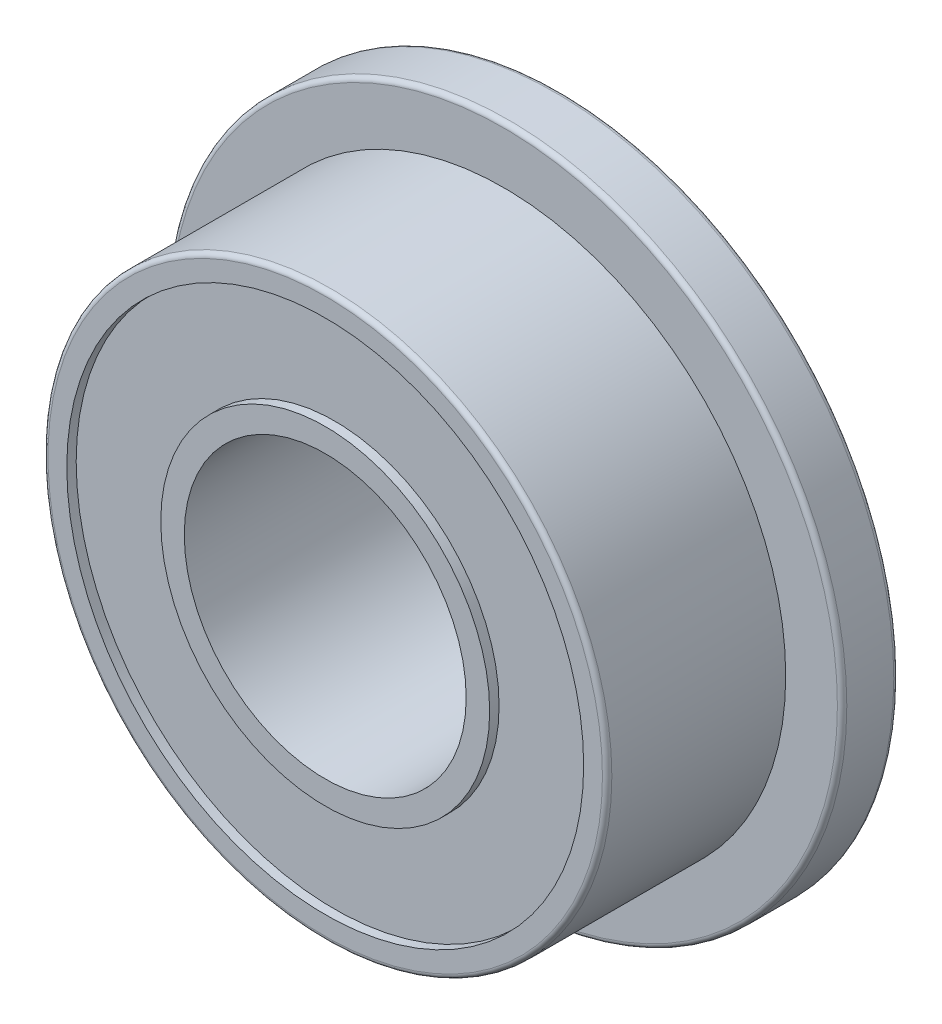
ISO-10303-21;
HEADER;
FILE_DESCRIPTION(('STEP AP214'),'2;1');
FILE_NAME('part.step','',(''),(''),'','','');
FILE_SCHEMA(('AUTOMOTIVE_DESIGN { 1 0 10303 214 1 1 1 1 }'));
ENDSEC;
DATA;
#1=APPLICATION_CONTEXT('core data for automotive mechanical design processes');
#2=APPLICATION_PROTOCOL_DEFINITION('international standard','automotive_design',2000,#1);
#3=PRODUCT_CONTEXT('',#1,'mechanical');
#4=PRODUCT('Part','Part','',(#3));
#5=PRODUCT_RELATED_PRODUCT_CATEGORY('part','',(#4));
#6=PRODUCT_DEFINITION_FORMATION('','',#4);
#7=PRODUCT_DEFINITION_CONTEXT('part definition',#1,'design');
#8=PRODUCT_DEFINITION('design','',#6,#7);
#9=PRODUCT_DEFINITION_SHAPE('','',#8);
#10=(LENGTH_UNIT() NAMED_UNIT(*) SI_UNIT(.MILLI.,.METRE.));
#11=(NAMED_UNIT(*) PLANE_ANGLE_UNIT() SI_UNIT($,.RADIAN.));
#12=(NAMED_UNIT(*) SI_UNIT($,.STERADIAN.) SOLID_ANGLE_UNIT());
#13=UNCERTAINTY_MEASURE_WITH_UNIT(LENGTH_MEASURE(1.E-05),#10,'distance_accuracy_value','');
#14=(GEOMETRIC_REPRESENTATION_CONTEXT(3) GLOBAL_UNCERTAINTY_ASSIGNED_CONTEXT((#13)) GLOBAL_UNIT_ASSIGNED_CONTEXT((#10,
#11,#12)) REPRESENTATION_CONTEXT('',''));
#15=CARTESIAN_POINT('',(0.,0.,0.));
#16=DIRECTION('',(0.,0.,1.));
#17=DIRECTION('',(1.,0.,0.));
#18=AXIS2_PLACEMENT_3D('',#15,#16,#17);
#19=CARTESIAN_POINT('',(0.,0.,1.25));
#20=DIRECTION('',(0.,0.,-1.));
#21=DIRECTION('',(-1.,0.,0.));
#22=AXIS2_PLACEMENT_3D('',#19,#20,#21);
#23=CYLINDRICAL_SURFACE('',#22,1.5);
#24=CARTESIAN_POINT('',(0.,0.,0.));
#25=DIRECTION('',(0.,0.,-1.));
#26=DIRECTION('',(1.,0.,0.));
#27=AXIS2_PLACEMENT_3D('',#24,#25,#26);
#28=CIRCLE('',#27,1.5);
#29=CARTESIAN_POINT('',(1.5,0.,0.));
#30=VERTEX_POINT('',#29);
#31=EDGE_CURVE('E27',#30,#30,#28,.T.);
#32=ORIENTED_EDGE('',*,*,#31,.T.);
#33=DIRECTION('',(0.,0.,1.));
#34=VECTOR('',#33,1.);
#35=CARTESIAN_POINT('',(1.5,0.,1.25));
#36=LINE('',#35,#34);
#37=CARTESIAN_POINT('',(1.5,0.,2.5));
#38=VERTEX_POINT('',#37);
#39=EDGE_CURVE('E11',#30,#38,#36,.T.);
#40=ORIENTED_EDGE('',*,*,#39,.T.);
#41=CARTESIAN_POINT('',(0.,0.,2.5));
#42=DIRECTION('',(0.,0.,-1.));
#43=DIRECTION('',(1.,0.,0.));
#44=AXIS2_PLACEMENT_3D('',#41,#42,#43);
#45=CIRCLE('',#44,1.5);
#46=EDGE_CURVE('E178',#38,#38,#45,.T.);
#47=ORIENTED_EDGE('',*,*,#46,.F.);
#48=ORIENTED_EDGE('',*,*,#39,.F.);
#49=EDGE_LOOP('',(#32,#40,#47,#48));
#50=FACE_BOUND('',#49,.T.);
#51=ADVANCED_FACE('F16',(#50),#23,.F.);
#52=CARTESIAN_POINT('',(-1.5,0.,0.));
#53=DIRECTION('',(0.,0.,-1.));
#54=DIRECTION('',(0.,-1.,0.));
#55=AXIS2_PLACEMENT_3D('',#52,#53,#54);
#56=PLANE('',#55);
#57=ORIENTED_EDGE('',*,*,#31,.F.);
#58=EDGE_LOOP('',(#57));
#59=FACE_BOUND('',#58,.T.);
#60=CARTESIAN_POINT('',(0.,0.,0.));
#61=DIRECTION('',(0.,0.,-1.));
#62=DIRECTION('',(1.,0.,0.));
#63=AXIS2_PLACEMENT_3D('',#60,#61,#62);
#64=CIRCLE('',#63,1.75);
#65=CARTESIAN_POINT('',(-1.75,0.,0.));
#66=VERTEX_POINT('',#65);
#67=EDGE_CURVE('E170',#66,#66,#64,.T.);
#68=ORIENTED_EDGE('',*,*,#67,.T.);
#69=EDGE_LOOP('',(#68));
#70=FACE_BOUND('',#69,.T.);
#71=ADVANCED_FACE('F243',(#59,#70),#56,.T.);
#72=CARTESIAN_POINT('',(-3.,0.,2.5));
#73=DIRECTION('',(0.,0.,1.));
#74=DIRECTION('',(1.,0.,0.));
#75=AXIS2_PLACEMENT_3D('',#72,#73,#74);
#76=PLANE('',#75);
#77=ORIENTED_EDGE('',*,*,#46,.T.);
#78=EDGE_LOOP('',(#77));
#79=FACE_BOUND('',#78,.T.);
#80=CARTESIAN_POINT('',(0.,0.,2.5));
#81=DIRECTION('',(0.,0.,1.));
#82=DIRECTION('',(-1.,0.,0.));
#83=AXIS2_PLACEMENT_3D('',#80,#81,#82);
#84=CIRCLE('',#83,1.75);
#85=CARTESIAN_POINT('',(1.75,0.,2.5));
#86=VERTEX_POINT('',#85);
#87=EDGE_CURVE('E159',#86,#86,#84,.T.);
#88=ORIENTED_EDGE('',*,*,#87,.T.);
#89=EDGE_LOOP('',(#88));
#90=FACE_BOUND('',#89,.T.);
#91=ADVANCED_FACE('F239',(#79,#90),#76,.T.);
#92=CARTESIAN_POINT('',(0.,0.,2.4));
#93=DIRECTION('',(0.,0.,1.));
#94=DIRECTION('',(1.,0.,0.));
#95=AXIS2_PLACEMENT_3D('',#92,#93,#94);
#96=PLANE('',#95);
#97=CARTESIAN_POINT('',(0.,0.,2.4));
#98=DIRECTION('',(0.,0.,1.));
#99=DIRECTION('',(-1.,0.,0.));
#100=AXIS2_PLACEMENT_3D('',#97,#98,#99);
#101=CIRCLE('',#100,1.75);
#102=CARTESIAN_POINT('',(1.75,0.,2.4));
#103=VERTEX_POINT('',#102);
#104=EDGE_CURVE('E20',#103,#103,#101,.T.);
#105=ORIENTED_EDGE('',*,*,#104,.F.);
#106=EDGE_LOOP('',(#105));
#107=FACE_BOUND('',#106,.T.);
#108=CARTESIAN_POINT('',(0.,0.,2.4));
#109=DIRECTION('',(0.,0.,-1.));
#110=DIRECTION('',(-1.,0.,0.));
#111=AXIS2_PLACEMENT_3D('',#108,#109,#110);
#112=CIRCLE('',#111,2.75);
#113=CARTESIAN_POINT('',(2.75,0.,2.4));
#114=VERTEX_POINT('',#113);
#115=EDGE_CURVE('E175',#114,#114,#112,.T.);
#116=ORIENTED_EDGE('',*,*,#115,.F.);
#117=EDGE_LOOP('',(#116));
#118=FACE_BOUND('',#117,.T.);
#119=ADVANCED_FACE('F277',(#107,#118),#96,.T.);
#120=CARTESIAN_POINT('',(0.,0.,2.5));
#121=DIRECTION('',(0.,0.,-1.));
#122=DIRECTION('',(-1.,0.,0.));
#123=AXIS2_PLACEMENT_3D('',#120,#121,#122);
#124=CYLINDRICAL_SURFACE('',#123,2.75);
#125=CARTESIAN_POINT('',(0.,0.,2.5));
#126=DIRECTION('',(0.,0.,-1.));
#127=DIRECTION('',(-1.,0.,0.));
#128=AXIS2_PLACEMENT_3D('',#125,#126,#127);
#129=CIRCLE('',#128,2.75);
#130=CARTESIAN_POINT('',(2.75,0.,2.5));
#131=VERTEX_POINT('',#130);
#132=EDGE_CURVE('E171',#131,#131,#129,.T.);
#133=ORIENTED_EDGE('',*,*,#132,.F.);
#134=DIRECTION('',(0.,0.,-1.));
#135=VECTOR('',#134,1.);
#136=CARTESIAN_POINT('',(2.75,0.,2.5));
#137=LINE('',#136,#135);
#138=EDGE_CURVE('E83',#131,#114,#137,.T.);
#139=ORIENTED_EDGE('',*,*,#138,.T.);
#140=ORIENTED_EDGE('',*,*,#115,.T.);
#141=ORIENTED_EDGE('',*,*,#138,.F.);
#142=EDGE_LOOP('',(#133,#139,#140,#141));
#143=FACE_BOUND('',#142,.T.);
#144=ADVANCED_FACE('F280',(#143),#124,.F.);
#145=CARTESIAN_POINT('',(0.,0.,2.5));
#146=DIRECTION('',(0.,0.,-1.));
#147=DIRECTION('',(-1.,0.,0.));
#148=AXIS2_PLACEMENT_3D('',#145,#146,#147);
#149=CYLINDRICAL_SURFACE('',#148,1.75);
#150=ORIENTED_EDGE('',*,*,#87,.F.);
#151=DIRECTION('',(0.,0.,-1.));
#152=VECTOR('',#151,1.);
#153=CARTESIAN_POINT('',(1.75,0.,2.5));
#154=LINE('',#153,#152);
#155=EDGE_CURVE('E53',#86,#103,#154,.T.);
#156=ORIENTED_EDGE('',*,*,#155,.T.);
#157=ORIENTED_EDGE('',*,*,#104,.T.);
#158=ORIENTED_EDGE('',*,*,#155,.F.);
#159=EDGE_LOOP('',(#150,#156,#157,#158));
#160=FACE_BOUND('',#159,.T.);
#161=ADVANCED_FACE('F18',(#160),#149,.T.);
#162=CARTESIAN_POINT('',(0.,0.,0.1));
#163=DIRECTION('',(0.,0.,-1.));
#164=DIRECTION('',(0.,-1.,0.));
#165=AXIS2_PLACEMENT_3D('',#162,#163,#164);
#166=PLANE('',#165);
#167=CARTESIAN_POINT('',(0.,0.,0.1));
#168=DIRECTION('',(0.,0.,-1.));
#169=DIRECTION('',(1.,0.,0.));
#170=AXIS2_PLACEMENT_3D('',#167,#168,#169);
#171=CIRCLE('',#170,1.75);
#172=CARTESIAN_POINT('',(-1.75,0.,0.1));
#173=VERTEX_POINT('',#172);
#174=EDGE_CURVE('E187',#173,#173,#171,.T.);
#175=ORIENTED_EDGE('',*,*,#174,.F.);
#176=EDGE_LOOP('',(#175));
#177=FACE_BOUND('',#176,.T.);
#178=CARTESIAN_POINT('',(0.,0.,0.1));
#179=DIRECTION('',(0.,0.,1.));
#180=DIRECTION('',(1.,0.,0.));
#181=AXIS2_PLACEMENT_3D('',#178,#179,#180);
#182=CIRCLE('',#181,2.75);
#183=CARTESIAN_POINT('',(-2.75,0.,0.1));
#184=VERTEX_POINT('',#183);
#185=EDGE_CURVE('E68',#184,#184,#182,.T.);
#186=ORIENTED_EDGE('',*,*,#185,.F.);
#187=EDGE_LOOP('',(#186));
#188=FACE_BOUND('',#187,.T.);
#189=ADVANCED_FACE('F259',(#177,#188),#166,.T.);
#190=CARTESIAN_POINT('',(0.,0.,0.));
#191=DIRECTION('',(0.,0.,1.));
#192=DIRECTION('',(1.,0.,0.));
#193=AXIS2_PLACEMENT_3D('',#190,#191,#192);
#194=CYLINDRICAL_SURFACE('',#193,2.75);
#195=CARTESIAN_POINT('',(0.,0.,0.));
#196=DIRECTION('',(0.,0.,1.));
#197=DIRECTION('',(1.,0.,0.));
#198=AXIS2_PLACEMENT_3D('',#195,#196,#197);
#199=CIRCLE('',#198,2.75);
#200=CARTESIAN_POINT('',(-2.75,0.,0.));
#201=VERTEX_POINT('',#200);
#202=EDGE_CURVE('E154',#201,#201,#199,.T.);
#203=ORIENTED_EDGE('',*,*,#202,.F.);
#204=DIRECTION('',(0.,0.,1.));
#205=VECTOR('',#204,1.);
#206=CARTESIAN_POINT('',(-2.75,0.,0.));
#207=LINE('',#206,#205);
#208=EDGE_CURVE('E190',#201,#184,#207,.T.);
#209=ORIENTED_EDGE('',*,*,#208,.T.);
#210=ORIENTED_EDGE('',*,*,#185,.T.);
#211=ORIENTED_EDGE('',*,*,#208,.F.);
#212=EDGE_LOOP('',(#203,#209,#210,#211));
#213=FACE_BOUND('',#212,.T.);
#214=ADVANCED_FACE('F217',(#213),#194,.F.);
#215=CARTESIAN_POINT('',(0.,0.,0.));
#216=DIRECTION('',(0.,0.,1.));
#217=DIRECTION('',(1.,0.,0.));
#218=AXIS2_PLACEMENT_3D('',#215,#216,#217);
#219=CYLINDRICAL_SURFACE('',#218,1.75);
#220=ORIENTED_EDGE('',*,*,#67,.F.);
#221=DIRECTION('',(0.,0.,1.));
#222=VECTOR('',#221,1.);
#223=CARTESIAN_POINT('',(-1.75,0.,0.));
#224=LINE('',#223,#222);
#225=EDGE_CURVE('E183',#66,#173,#224,.T.);
#226=ORIENTED_EDGE('',*,*,#225,.T.);
#227=ORIENTED_EDGE('',*,*,#174,.T.);
#228=ORIENTED_EDGE('',*,*,#225,.F.);
#229=EDGE_LOOP('',(#220,#226,#227,#228));
#230=FACE_BOUND('',#229,.T.);
#231=ADVANCED_FACE('F248',(#230),#219,.T.);
#232=CARTESIAN_POINT('',(0.,0.,1.55));
#233=DIRECTION('',(0.,0.,-1.));
#234=DIRECTION('',(-1.,0.,0.));
#235=AXIS2_PLACEMENT_3D('',#232,#233,#234);
#236=CYLINDRICAL_SURFACE('',#235,3.);
#237=CARTESIAN_POINT('',(0.,0.,0.6));
#238=DIRECTION('',(0.,0.,-1.));
#239=DIRECTION('',(1.,0.,0.));
#240=AXIS2_PLACEMENT_3D('',#237,#238,#239);
#241=CIRCLE('',#240,3.);
#242=CARTESIAN_POINT('',(3.,0.,0.6));
#243=VERTEX_POINT('',#242);
#244=EDGE_CURVE('E145',#243,#243,#241,.T.);
#245=ORIENTED_EDGE('',*,*,#244,.F.);
#246=DIRECTION('',(0.,0.,1.));
#247=VECTOR('',#246,1.);
#248=CARTESIAN_POINT('',(3.,0.,1.55));
#249=LINE('',#248,#247);
#250=CARTESIAN_POINT('',(3.,0.,2.45));
#251=VERTEX_POINT('',#250);
#252=EDGE_CURVE('E137',#243,#251,#249,.T.);
#253=ORIENTED_EDGE('',*,*,#252,.T.);
#254=CARTESIAN_POINT('',(0.,0.,2.45));
#255=DIRECTION('',(0.,0.,1.));
#256=DIRECTION('',(1.,0.,0.));
#257=AXIS2_PLACEMENT_3D('',#254,#255,#256);
#258=CIRCLE('',#257,3.);
#259=EDGE_CURVE('E152',#251,#251,#258,.T.);
#260=ORIENTED_EDGE('',*,*,#259,.F.);
#261=ORIENTED_EDGE('',*,*,#252,.F.);
#262=EDGE_LOOP('',(#245,#253,#260,#261));
#263=FACE_BOUND('',#262,.T.);
#264=ADVANCED_FACE('F250',(#263),#236,.T.);
#265=CARTESIAN_POINT('',(-3.,0.,2.5));
#266=DIRECTION('',(0.,0.,1.));
#267=DIRECTION('',(1.,0.,0.));
#268=AXIS2_PLACEMENT_3D('',#265,#266,#267);
#269=PLANE('',#268);
#270=ORIENTED_EDGE('',*,*,#132,.T.);
#271=EDGE_LOOP('',(#270));
#272=FACE_BOUND('',#271,.T.);
#273=CARTESIAN_POINT('',(0.,0.,2.5));
#274=DIRECTION('',(0.,0.,-1.));
#275=DIRECTION('',(1.,0.,0.));
#276=AXIS2_PLACEMENT_3D('',#273,#274,#275);
#277=CIRCLE('',#276,2.95);
#278=CARTESIAN_POINT('',(2.95,0.,2.5));
#279=VERTEX_POINT('',#278);
#280=EDGE_CURVE('E98',#279,#279,#277,.T.);
#281=ORIENTED_EDGE('',*,*,#280,.F.);
#282=EDGE_LOOP('',(#281));
#283=FACE_BOUND('',#282,.T.);
#284=ADVANCED_FACE('F257',(#272,#283),#269,.T.);
#285=CARTESIAN_POINT('',(0.,0.,2.45));
#286=DIRECTION('',(0.,0.,-1.));
#287=DIRECTION('',(-1.,0.,0.));
#288=AXIS2_PLACEMENT_3D('',#285,#286,#287);
#289=TOROIDAL_SURFACE('',#288,2.95,0.05);
#290=ORIENTED_EDGE('',*,*,#259,.T.);
#291=CARTESIAN_POINT('',(2.95,0.,2.45));
#292=DIRECTION('',(0.,-1.,0.));
#293=DIRECTION('',(1.,0.,0.));
#294=AXIS2_PLACEMENT_3D('',#291,#292,#293);
#295=CIRCLE('',#294,0.05);
#296=EDGE_CURVE('E182',#251,#279,#295,.T.);
#297=ORIENTED_EDGE('',*,*,#296,.T.);
#298=ORIENTED_EDGE('',*,*,#280,.T.);
#299=ORIENTED_EDGE('',*,*,#296,.F.);
#300=EDGE_LOOP('',(#290,#297,#298,#299));
#301=FACE_BOUND('',#300,.T.);
#302=ADVANCED_FACE('F272',(#301),#289,.T.);
#303=CARTESIAN_POINT('',(-3.6,0.,0.6));
#304=DIRECTION('',(0.,0.,1.));
#305=DIRECTION('',(1.,0.,0.));
#306=AXIS2_PLACEMENT_3D('',#303,#304,#305);
#307=PLANE('',#306);
#308=ORIENTED_EDGE('',*,*,#244,.T.);
#309=EDGE_LOOP('',(#308));
#310=FACE_BOUND('',#309,.T.);
#311=CARTESIAN_POINT('',(0.,0.,0.6));
#312=DIRECTION('',(0.,0.,-1.));
#313=DIRECTION('',(1.,0.,0.));
#314=AXIS2_PLACEMENT_3D('',#311,#312,#313);
#315=CIRCLE('',#314,3.55);
#316=CARTESIAN_POINT('',(3.55,0.,0.6));
#317=VERTEX_POINT('',#316);
#318=EDGE_CURVE('E141',#317,#317,#315,.T.);
#319=ORIENTED_EDGE('',*,*,#318,.F.);
#320=EDGE_LOOP('',(#319));
#321=FACE_BOUND('',#320,.T.);
#322=ADVANCED_FACE('F269',(#310,#321),#307,.T.);
#323=CARTESIAN_POINT('',(0.,0.,0.55));
#324=DIRECTION('',(0.,0.,-1.));
#325=DIRECTION('',(-1.,0.,0.));
#326=AXIS2_PLACEMENT_3D('',#323,#324,#325);
#327=TOROIDAL_SURFACE('',#326,3.55,0.05);
#328=CARTESIAN_POINT('',(0.,0.,0.55));
#329=DIRECTION('',(0.,0.,1.));
#330=DIRECTION('',(1.,0.,0.));
#331=AXIS2_PLACEMENT_3D('',#328,#329,#330);
#332=CIRCLE('',#331,3.6);
#333=CARTESIAN_POINT('',(3.6,0.,0.55));
#334=VERTEX_POINT('',#333);
#335=EDGE_CURVE('E172',#334,#334,#332,.T.);
#336=ORIENTED_EDGE('',*,*,#335,.T.);
#337=CARTESIAN_POINT('',(3.55,0.,0.55));
#338=DIRECTION('',(0.,-1.,0.));
#339=DIRECTION('',(1.,0.,0.));
#340=AXIS2_PLACEMENT_3D('',#337,#338,#339);
#341=CIRCLE('',#340,0.05);
#342=EDGE_CURVE('E117',#334,#317,#341,.T.);
#343=ORIENTED_EDGE('',*,*,#342,.T.);
#344=ORIENTED_EDGE('',*,*,#318,.T.);
#345=ORIENTED_EDGE('',*,*,#342,.F.);
#346=EDGE_LOOP('',(#336,#343,#344,#345));
#347=FACE_BOUND('',#346,.T.);
#348=ADVANCED_FACE('F142',(#347),#327,.T.);
#349=CARTESIAN_POINT('',(-1.5,0.,0.));
#350=DIRECTION('',(0.,0.,-1.));
#351=DIRECTION('',(0.,-1.,0.));
#352=AXIS2_PLACEMENT_3D('',#349,#350,#351);
#353=PLANE('',#352);
#354=ORIENTED_EDGE('',*,*,#202,.T.);
#355=EDGE_LOOP('',(#354));
#356=FACE_BOUND('',#355,.T.);
#357=CARTESIAN_POINT('',(0.,0.,0.));
#358=DIRECTION('',(0.,0.,1.));
#359=DIRECTION('',(1.,0.,0.));
#360=AXIS2_PLACEMENT_3D('',#357,#358,#359);
#361=CIRCLE('',#360,3.55);
#362=CARTESIAN_POINT('',(3.55,0.,0.));
#363=VERTEX_POINT('',#362);
#364=EDGE_CURVE('E167',#363,#363,#361,.T.);
#365=ORIENTED_EDGE('',*,*,#364,.F.);
#366=EDGE_LOOP('',(#365));
#367=FACE_BOUND('',#366,.T.);
#368=ADVANCED_FACE('F215',(#356,#367),#353,.T.);
#369=CARTESIAN_POINT('',(0.,0.,0.3));
#370=DIRECTION('',(0.,0.,-1.));
#371=DIRECTION('',(-1.,0.,0.));
#372=AXIS2_PLACEMENT_3D('',#369,#370,#371);
#373=CYLINDRICAL_SURFACE('',#372,3.6);
#374=CARTESIAN_POINT('',(0.,0.,0.05));
#375=DIRECTION('',(0.,0.,-1.));
#376=DIRECTION('',(1.,0.,0.));
#377=AXIS2_PLACEMENT_3D('',#374,#375,#376);
#378=CIRCLE('',#377,3.6);
#379=CARTESIAN_POINT('',(3.6,0.,0.05));
#380=VERTEX_POINT('',#379);
#381=EDGE_CURVE('E166',#380,#380,#378,.T.);
#382=ORIENTED_EDGE('',*,*,#381,.F.);
#383=DIRECTION('',(0.,0.,1.));
#384=VECTOR('',#383,1.);
#385=CARTESIAN_POINT('',(3.6,0.,0.3));
#386=LINE('',#385,#384);
#387=EDGE_CURVE('E127',#380,#334,#386,.T.);
#388=ORIENTED_EDGE('',*,*,#387,.T.);
#389=ORIENTED_EDGE('',*,*,#335,.F.);
#390=ORIENTED_EDGE('',*,*,#387,.F.);
#391=EDGE_LOOP('',(#382,#388,#389,#390));
#392=FACE_BOUND('',#391,.T.);
#393=ADVANCED_FACE('F276',(#392),#373,.T.);
#394=CARTESIAN_POINT('',(0.,0.,0.05));
#395=DIRECTION('',(0.,0.,-1.));
#396=DIRECTION('',(-1.,0.,0.));
#397=AXIS2_PLACEMENT_3D('',#394,#395,#396);
#398=TOROIDAL_SURFACE('',#397,3.55,0.05);
#399=ORIENTED_EDGE('',*,*,#364,.T.);
#400=CARTESIAN_POINT('',(3.55,0.,0.05));
#401=DIRECTION('',(0.,-1.,0.));
#402=DIRECTION('',(1.,0.,0.));
#403=AXIS2_PLACEMENT_3D('',#400,#401,#402);
#404=CIRCLE('',#403,0.05);
#405=EDGE_CURVE('E162',#363,#380,#404,.T.);
#406=ORIENTED_EDGE('',*,*,#405,.T.);
#407=ORIENTED_EDGE('',*,*,#381,.T.);
#408=ORIENTED_EDGE('',*,*,#405,.F.);
#409=EDGE_LOOP('',(#399,#406,#407,#408));
#410=FACE_BOUND('',#409,.T.);
#411=ADVANCED_FACE('F267',(#410),#398,.T.);
#412=CLOSED_SHELL('',(#51,#71,#91,#119,#144,#161,#189,#214,#231,#264,#284,#302,#322,#348,#368,
#393,#411));
#413=MANIFOLD_SOLID_BREP('B1',#412);
#414=ADVANCED_BREP_SHAPE_REPRESENTATION('',(#18,#413),#14);
#415=SHAPE_DEFINITION_REPRESENTATION(#9,#414);
ENDSEC;
END-ISO-10303-21;
